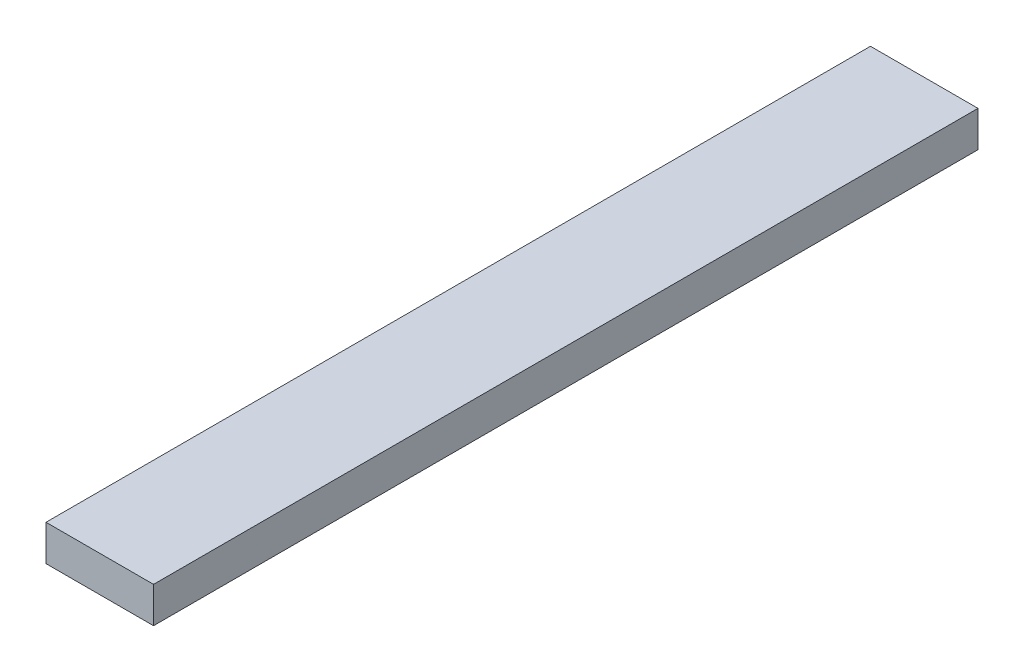
ISO-10303-21;
HEADER;
FILE_DESCRIPTION(('STEP AP214'),'2;1');
FILE_NAME('part.step','',(''),(''),'','','');
FILE_SCHEMA(('AUTOMOTIVE_DESIGN { 1 0 10303 214 1 1 1 1 }'));
ENDSEC;
DATA;
#1=APPLICATION_CONTEXT('core data for automotive mechanical design processes');
#2=APPLICATION_PROTOCOL_DEFINITION('international standard','automotive_design',2000,#1);
#3=PRODUCT_CONTEXT('',#1,'mechanical');
#4=PRODUCT('Part','Part','',(#3));
#5=PRODUCT_RELATED_PRODUCT_CATEGORY('part','',(#4));
#6=PRODUCT_DEFINITION_FORMATION('','',#4);
#7=PRODUCT_DEFINITION_CONTEXT('part definition',#1,'design');
#8=PRODUCT_DEFINITION('design','',#6,#7);
#9=PRODUCT_DEFINITION_SHAPE('','',#8);
#10=(LENGTH_UNIT() NAMED_UNIT(*) SI_UNIT(.MILLI.,.METRE.));
#11=(NAMED_UNIT(*) PLANE_ANGLE_UNIT() SI_UNIT($,.RADIAN.));
#12=(NAMED_UNIT(*) SI_UNIT($,.STERADIAN.) SOLID_ANGLE_UNIT());
#13=UNCERTAINTY_MEASURE_WITH_UNIT(LENGTH_MEASURE(1.E-05),#10,'distance_accuracy_value','');
#14=(GEOMETRIC_REPRESENTATION_CONTEXT(3) GLOBAL_UNCERTAINTY_ASSIGNED_CONTEXT((#13)) GLOBAL_UNIT_ASSIGNED_CONTEXT((#10,
#11,#12)) REPRESENTATION_CONTEXT('',''));
#15=CARTESIAN_POINT('',(0.,0.,0.));
#16=DIRECTION('',(0.,0.,1.));
#17=DIRECTION('',(1.,0.,0.));
#18=AXIS2_PLACEMENT_3D('',#15,#16,#17);
#19=CARTESIAN_POINT('',(30.,-9.99999999999998,230.));
#20=DIRECTION('',(-1.,0.,0.));
#21=DIRECTION('',(0.,0.,1.));
#22=AXIS2_PLACEMENT_3D('',#19,#20,#21);
#23=PLANE('',#22);
#24=DIRECTION('',(0.,1.,0.));
#25=VECTOR('',#24,1.);
#26=CARTESIAN_POINT('',(30.,-9.99999999999998,-230.));
#27=LINE('',#26,#25);
#28=CARTESIAN_POINT('',(30.,-9.99999999999998,-230.));
#29=VERTEX_POINT('',#28);
#30=CARTESIAN_POINT('',(30.,10.,-230.));
#31=VERTEX_POINT('',#30);
#32=EDGE_CURVE('E107',#29,#31,#27,.T.);
#33=ORIENTED_EDGE('',*,*,#32,.T.);
#34=DIRECTION('',(0.,0.,-1.));
#35=VECTOR('',#34,1.);
#36=CARTESIAN_POINT('',(30.,10.,230.));
#37=LINE('',#36,#35);
#38=CARTESIAN_POINT('',(30.,10.,230.));
#39=VERTEX_POINT('',#38);
#40=EDGE_CURVE('E11',#39,#31,#37,.T.);
#41=ORIENTED_EDGE('',*,*,#40,.F.);
#42=DIRECTION('',(0.,1.,0.));
#43=VECTOR('',#42,1.);
#44=CARTESIAN_POINT('',(30.,-9.99999999999998,230.));
#45=LINE('',#44,#43);
#46=CARTESIAN_POINT('',(30.,-9.99999999999998,230.));
#47=VERTEX_POINT('',#46);
#48=EDGE_CURVE('E91',#47,#39,#45,.T.);
#49=ORIENTED_EDGE('',*,*,#48,.F.);
#50=DIRECTION('',(0.,0.,-1.));
#51=VECTOR('',#50,1.);
#52=CARTESIAN_POINT('',(30.,-9.99999999999998,230.));
#53=LINE('',#52,#51);
#54=EDGE_CURVE('E103',#47,#29,#53,.T.);
#55=ORIENTED_EDGE('',*,*,#54,.T.);
#56=EDGE_LOOP('',(#33,#41,#49,#55));
#57=FACE_BOUND('',#56,.T.);
#58=ADVANCED_FACE('F39',(#57),#23,.F.);
#59=CARTESIAN_POINT('',(-30.,10.,230.));
#60=DIRECTION('',(0.,-1.,0.));
#61=DIRECTION('',(0.,0.,-1.));
#62=AXIS2_PLACEMENT_3D('',#59,#60,#61);
#63=PLANE('',#62);
#64=DIRECTION('',(-1.,0.,0.));
#65=VECTOR('',#64,1.);
#66=CARTESIAN_POINT('',(-30.,10.,-230.));
#67=LINE('',#66,#65);
#68=CARTESIAN_POINT('',(-30.,10.,-230.));
#69=VERTEX_POINT('',#68);
#70=EDGE_CURVE('E96',#31,#69,#67,.T.);
#71=ORIENTED_EDGE('',*,*,#70,.T.);
#72=DIRECTION('',(0.,0.,-1.));
#73=VECTOR('',#72,1.);
#74=CARTESIAN_POINT('',(-30.,10.,230.));
#75=LINE('',#74,#73);
#76=CARTESIAN_POINT('',(-30.,10.,230.));
#77=VERTEX_POINT('',#76);
#78=EDGE_CURVE('E48',#77,#69,#75,.T.);
#79=ORIENTED_EDGE('',*,*,#78,.F.);
#80=DIRECTION('',(-1.,0.,0.));
#81=VECTOR('',#80,1.);
#82=CARTESIAN_POINT('',(-30.,10.,230.));
#83=LINE('',#82,#81);
#84=EDGE_CURVE('E86',#39,#77,#83,.T.);
#85=ORIENTED_EDGE('',*,*,#84,.F.);
#86=ORIENTED_EDGE('',*,*,#40,.T.);
#87=EDGE_LOOP('',(#71,#79,#85,#86));
#88=FACE_BOUND('',#87,.T.);
#89=ADVANCED_FACE('F95',(#88),#63,.F.);
#90=CARTESIAN_POINT('',(-30.,-9.99999999999998,230.));
#91=DIRECTION('',(1.,0.,0.));
#92=DIRECTION('',(0.,0.,-1.));
#93=AXIS2_PLACEMENT_3D('',#90,#91,#92);
#94=PLANE('',#93);
#95=DIRECTION('',(0.,-1.,0.));
#96=VECTOR('',#95,1.);
#97=CARTESIAN_POINT('',(-30.,-9.99999999999998,-230.));
#98=LINE('',#97,#96);
#99=CARTESIAN_POINT('',(-30.,-9.99999999999998,-230.));
#100=VERTEX_POINT('',#99);
#101=EDGE_CURVE('E73',#69,#100,#98,.T.);
#102=ORIENTED_EDGE('',*,*,#101,.T.);
#103=DIRECTION('',(0.,0.,-1.));
#104=VECTOR('',#103,1.);
#105=CARTESIAN_POINT('',(-30.,-9.99999999999998,230.));
#106=LINE('',#105,#104);
#107=CARTESIAN_POINT('',(-30.,-9.99999999999998,230.));
#108=VERTEX_POINT('',#107);
#109=EDGE_CURVE('E98',#108,#100,#106,.T.);
#110=ORIENTED_EDGE('',*,*,#109,.F.);
#111=DIRECTION('',(0.,-1.,0.));
#112=VECTOR('',#111,1.);
#113=CARTESIAN_POINT('',(-30.,-9.99999999999998,230.));
#114=LINE('',#113,#112);
#115=EDGE_CURVE('E89',#77,#108,#114,.T.);
#116=ORIENTED_EDGE('',*,*,#115,.F.);
#117=ORIENTED_EDGE('',*,*,#78,.T.);
#118=EDGE_LOOP('',(#102,#110,#116,#117));
#119=FACE_BOUND('',#118,.T.);
#120=ADVANCED_FACE('F99',(#119),#94,.F.);
#121=CARTESIAN_POINT('',(-30.,-9.99999999999998,230.));
#122=DIRECTION('',(0.,1.,0.));
#123=DIRECTION('',(0.,0.,1.));
#124=AXIS2_PLACEMENT_3D('',#121,#122,#123);
#125=PLANE('',#124);
#126=DIRECTION('',(1.,0.,0.));
#127=VECTOR('',#126,1.);
#128=CARTESIAN_POINT('',(-30.,-9.99999999999998,-230.));
#129=LINE('',#128,#127);
#130=EDGE_CURVE('E79',#100,#29,#129,.T.);
#131=ORIENTED_EDGE('',*,*,#130,.T.);
#132=ORIENTED_EDGE('',*,*,#54,.F.);
#133=DIRECTION('',(1.,0.,0.));
#134=VECTOR('',#133,1.);
#135=CARTESIAN_POINT('',(-30.,-9.99999999999998,230.));
#136=LINE('',#135,#134);
#137=EDGE_CURVE('E56',#108,#47,#136,.T.);
#138=ORIENTED_EDGE('',*,*,#137,.F.);
#139=ORIENTED_EDGE('',*,*,#109,.T.);
#140=EDGE_LOOP('',(#131,#132,#138,#139));
#141=FACE_BOUND('',#140,.T.);
#142=ADVANCED_FACE('F120',(#141),#125,.F.);
#143=CARTESIAN_POINT('',(0.,0.,230.));
#144=DIRECTION('',(0.,0.,-1.));
#145=DIRECTION('',(-1.,0.,0.));
#146=AXIS2_PLACEMENT_3D('',#143,#144,#145);
#147=PLANE('',#146);
#148=ORIENTED_EDGE('',*,*,#48,.T.);
#149=ORIENTED_EDGE('',*,*,#84,.T.);
#150=ORIENTED_EDGE('',*,*,#115,.T.);
#151=ORIENTED_EDGE('',*,*,#137,.T.);
#152=EDGE_LOOP('',(#148,#149,#150,#151));
#153=FACE_BOUND('',#152,.T.);
#154=ADVANCED_FACE('F87',(#153),#147,.F.);
#155=CARTESIAN_POINT('',(0.,0.,-230.));
#156=DIRECTION('',(0.,0.,-1.));
#157=DIRECTION('',(-1.,0.,0.));
#158=AXIS2_PLACEMENT_3D('',#155,#156,#157);
#159=PLANE('',#158);
#160=ORIENTED_EDGE('',*,*,#32,.F.);
#161=ORIENTED_EDGE('',*,*,#130,.F.);
#162=ORIENTED_EDGE('',*,*,#101,.F.);
#163=ORIENTED_EDGE('',*,*,#70,.F.);
#164=EDGE_LOOP('',(#160,#161,#162,#163));
#165=FACE_BOUND('',#164,.T.);
#166=ADVANCED_FACE('F123',(#165),#159,.T.);
#167=CLOSED_SHELL('',(#58,#89,#120,#142,#154,#166));
#168=MANIFOLD_SOLID_BREP('B2',#167);
#169=ADVANCED_BREP_SHAPE_REPRESENTATION('',(#18,#168),#14);
#170=SHAPE_DEFINITION_REPRESENTATION(#9,#169);
ENDSEC;
END-ISO-10303-21;
